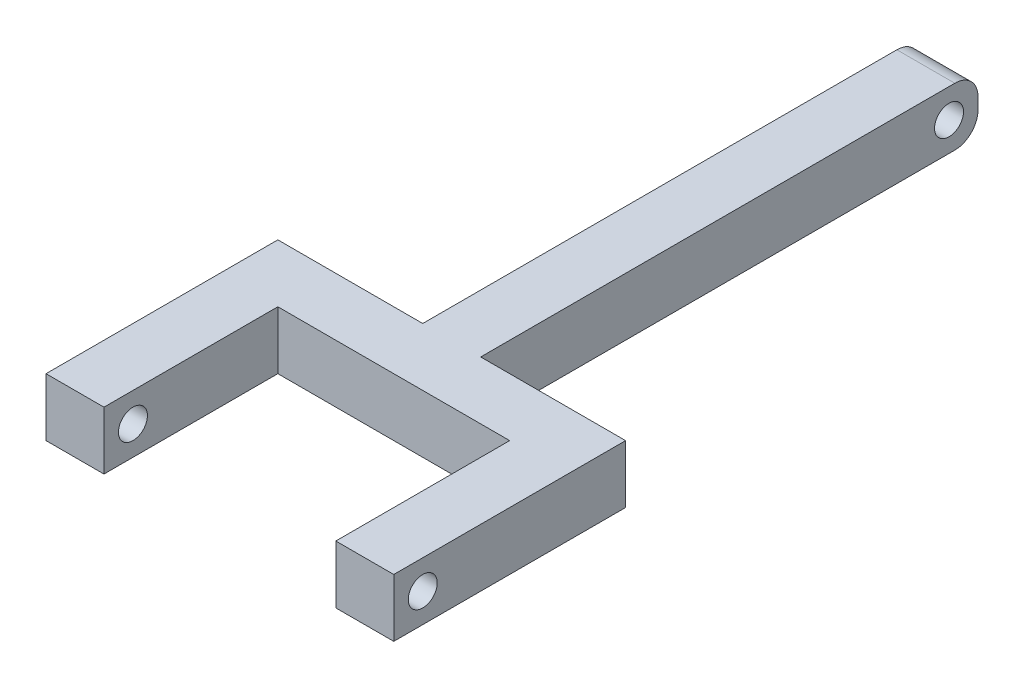
ISO-10303-21;
HEADER;
FILE_DESCRIPTION(('STEP AP214'),'2;1');
FILE_NAME('part.step','',(''),(''),'','','');
FILE_SCHEMA(('AUTOMOTIVE_DESIGN { 1 0 10303 214 1 1 1 1 }'));
ENDSEC;
DATA;
#1=APPLICATION_CONTEXT('core data for automotive mechanical design processes');
#2=APPLICATION_PROTOCOL_DEFINITION('international standard','automotive_design',2000,#1);
#3=PRODUCT_CONTEXT('',#1,'mechanical');
#4=PRODUCT('Part','Part','',(#3));
#5=PRODUCT_RELATED_PRODUCT_CATEGORY('part','',(#4));
#6=PRODUCT_DEFINITION_FORMATION('','',#4);
#7=PRODUCT_DEFINITION_CONTEXT('part definition',#1,'design');
#8=PRODUCT_DEFINITION('design','',#6,#7);
#9=PRODUCT_DEFINITION_SHAPE('','',#8);
#10=(LENGTH_UNIT() NAMED_UNIT(*) SI_UNIT(.MILLI.,.METRE.));
#11=(NAMED_UNIT(*) PLANE_ANGLE_UNIT() SI_UNIT($,.RADIAN.));
#12=(NAMED_UNIT(*) SI_UNIT($,.STERADIAN.) SOLID_ANGLE_UNIT());
#13=UNCERTAINTY_MEASURE_WITH_UNIT(LENGTH_MEASURE(1.E-05),#10,'distance_accuracy_value','');
#14=(GEOMETRIC_REPRESENTATION_CONTEXT(3) GLOBAL_UNCERTAINTY_ASSIGNED_CONTEXT((#13)) GLOBAL_UNIT_ASSIGNED_CONTEXT((#10,
#11,#12)) REPRESENTATION_CONTEXT('',''));
#15=CARTESIAN_POINT('',(0.,0.,0.));
#16=DIRECTION('',(0.,0.,1.));
#17=DIRECTION('',(1.,0.,0.));
#18=AXIS2_PLACEMENT_3D('',#15,#16,#17);
#19=CARTESIAN_POINT('',(-38.1,0.,0.));
#20=DIRECTION('',(1.,0.,0.));
#21=DIRECTION('',(0.,0.,-1.));
#22=AXIS2_PLACEMENT_3D('',#19,#20,#21);
#23=PLANE('',#22);
#24=DIRECTION('',(0.,0.,1.));
#25=VECTOR('',#24,1.);
#26=CARTESIAN_POINT('',(-38.1,6.35,28.956));
#27=LINE('',#26,#25);
#28=CARTESIAN_POINT('',(-38.1,6.35,28.956));
#29=VERTEX_POINT('',#28);
#30=CARTESIAN_POINT('',(-38.1,6.35,79.756));
#31=VERTEX_POINT('',#30);
#32=EDGE_CURVE('E136',#29,#31,#27,.T.);
#33=ORIENTED_EDGE('',*,*,#32,.F.);
#34=DIRECTION('',(0.,1.,0.));
#35=VECTOR('',#34,1.);
#36=CARTESIAN_POINT('',(-38.1,-6.35,28.956));
#37=LINE('',#36,#35);
#38=CARTESIAN_POINT('',(-38.1,-6.35,28.956));
#39=VERTEX_POINT('',#38);
#40=EDGE_CURVE('E209',#39,#29,#37,.T.);
#41=ORIENTED_EDGE('',*,*,#40,.F.);
#42=DIRECTION('',(0.,0.,-1.));
#43=VECTOR('',#42,1.);
#44=CARTESIAN_POINT('',(-38.1,-6.35,41.656));
#45=LINE('',#44,#43);
#46=CARTESIAN_POINT('',(-38.1,-6.35,79.756));
#47=VERTEX_POINT('',#46);
#48=EDGE_CURVE('E149',#47,#39,#45,.T.);
#49=ORIENTED_EDGE('',*,*,#48,.F.);
#50=DIRECTION('',(0.,-1.,0.));
#51=VECTOR('',#50,1.);
#52=CARTESIAN_POINT('',(-38.1,-6.35,79.756));
#53=LINE('',#52,#51);
#54=EDGE_CURVE('E155',#31,#47,#53,.T.);
#55=ORIENTED_EDGE('',*,*,#54,.F.);
#56=EDGE_LOOP('',(#33,#41,#49,#55));
#57=FACE_BOUND('',#56,.T.);
#58=CARTESIAN_POINT('',(-38.1,0.,73.406));
#59=DIRECTION('',(1.,0.,0.));
#60=DIRECTION('',(0.,0.,-1.));
#61=AXIS2_PLACEMENT_3D('',#58,#59,#60);
#62=CIRCLE('',#61,3.17500000000001);
#63=CARTESIAN_POINT('',(-38.1,0.,70.231));
#64=VERTEX_POINT('',#63);
#65=EDGE_CURVE('E163',#64,#64,#62,.F.);
#66=ORIENTED_EDGE('',*,*,#65,.F.);
#67=EDGE_LOOP('',(#66));
#68=FACE_BOUND('',#67,.T.);
#69=ADVANCED_FACE('F33',(#57,#68),#23,.F.);
#70=CARTESIAN_POINT('',(-25.4,-6.35,79.756));
#71=DIRECTION('',(-1.,0.,0.));
#72=DIRECTION('',(0.,0.,1.));
#73=AXIS2_PLACEMENT_3D('',#70,#71,#72);
#74=PLANE('',#73);
#75=DIRECTION('',(0.,0.,-1.));
#76=VECTOR('',#75,1.);
#77=CARTESIAN_POINT('',(-25.4,-6.35,79.756));
#78=LINE('',#77,#76);
#79=CARTESIAN_POINT('',(-25.4,-6.35,79.756));
#80=VERTEX_POINT('',#79);
#81=CARTESIAN_POINT('',(-25.4,-6.35,41.656));
#82=VERTEX_POINT('',#81);
#83=EDGE_CURVE('E174',#80,#82,#78,.T.);
#84=ORIENTED_EDGE('',*,*,#83,.T.);
#85=DIRECTION('',(0.,1.,0.));
#86=VECTOR('',#85,1.);
#87=CARTESIAN_POINT('',(-25.4,0.,41.656));
#88=LINE('',#87,#86);
#89=CARTESIAN_POINT('',(-25.4,6.35,41.656));
#90=VERTEX_POINT('',#89);
#91=EDGE_CURVE('E177',#82,#90,#88,.T.);
#92=ORIENTED_EDGE('',*,*,#91,.T.);
#93=DIRECTION('',(0.,0.,-1.));
#94=VECTOR('',#93,1.);
#95=CARTESIAN_POINT('',(-25.4,6.35,79.756));
#96=LINE('',#95,#94);
#97=CARTESIAN_POINT('',(-25.4,6.35,79.756));
#98=VERTEX_POINT('',#97);
#99=EDGE_CURVE('E173',#98,#90,#96,.T.);
#100=ORIENTED_EDGE('',*,*,#99,.F.);
#101=DIRECTION('',(0.,1.,0.));
#102=VECTOR('',#101,1.);
#103=CARTESIAN_POINT('',(-25.4,-6.35,79.756));
#104=LINE('',#103,#102);
#105=EDGE_CURVE('E157',#80,#98,#104,.T.);
#106=ORIENTED_EDGE('',*,*,#105,.F.);
#107=EDGE_LOOP('',(#84,#92,#100,#106));
#108=FACE_BOUND('',#107,.T.);
#109=CARTESIAN_POINT('',(-25.4,0.,73.406));
#110=DIRECTION('',(-1.,0.,0.));
#111=DIRECTION('',(0.,0.,1.));
#112=AXIS2_PLACEMENT_3D('',#109,#110,#111);
#113=CIRCLE('',#112,3.17500000000001);
#114=CARTESIAN_POINT('',(-25.4,0.,76.581));
#115=VERTEX_POINT('',#114);
#116=EDGE_CURVE('E166',#115,#115,#113,.T.);
#117=ORIENTED_EDGE('',*,*,#116,.T.);
#118=EDGE_LOOP('',(#117));
#119=FACE_BOUND('',#118,.T.);
#120=ADVANCED_FACE('F304',(#108,#119),#74,.F.);
#121=CARTESIAN_POINT('',(0.,0.,41.656));
#122=DIRECTION('',(0.,0.,-1.));
#123=DIRECTION('',(-1.,0.,0.));
#124=AXIS2_PLACEMENT_3D('',#121,#122,#123);
#125=PLANE('',#124);
#126=ORIENTED_EDGE('',*,*,#91,.F.);
#127=DIRECTION('',(1.,0.,0.));
#128=VECTOR('',#127,1.);
#129=CARTESIAN_POINT('',(-6.35,-6.35,41.656));
#130=LINE('',#129,#128);
#131=CARTESIAN_POINT('',(25.4,-6.35,41.656));
#132=VERTEX_POINT('',#131);
#133=EDGE_CURVE('E231',#82,#132,#130,.T.);
#134=ORIENTED_EDGE('',*,*,#133,.T.);
#135=DIRECTION('',(0.,1.,0.));
#136=VECTOR('',#135,1.);
#137=CARTESIAN_POINT('',(25.4,0.,41.656));
#138=LINE('',#137,#136);
#139=CARTESIAN_POINT('',(25.4,6.35,41.656));
#140=VERTEX_POINT('',#139);
#141=EDGE_CURVE('E150',#132,#140,#138,.T.);
#142=ORIENTED_EDGE('',*,*,#141,.T.);
#143=DIRECTION('',(-1.,0.,0.));
#144=VECTOR('',#143,1.);
#145=CARTESIAN_POINT('',(-6.35,6.35,41.656));
#146=LINE('',#145,#144);
#147=EDGE_CURVE('E233',#140,#90,#146,.T.);
#148=ORIENTED_EDGE('',*,*,#147,.T.);
#149=EDGE_LOOP('',(#126,#134,#142,#148));
#150=FACE_BOUND('',#149,.T.);
#151=ADVANCED_FACE('F308',(#150),#125,.F.);
#152=CARTESIAN_POINT('',(-6.35,-6.35,41.656));
#153=DIRECTION('',(1.,0.,0.));
#154=DIRECTION('',(0.,0.,-1.));
#155=AXIS2_PLACEMENT_3D('',#152,#153,#154);
#156=PLANE('',#155);
#157=CARTESIAN_POINT('',(-6.35,0.,-73.66));
#158=DIRECTION('',(-1.,0.,0.));
#159=DIRECTION('',(0.,0.,1.));
#160=AXIS2_PLACEMENT_3D('',#157,#158,#159);
#161=CIRCLE('',#160,3.175);
#162=CARTESIAN_POINT('',(-6.35,0.,-70.485));
#163=VERTEX_POINT('',#162);
#164=EDGE_CURVE('E250',#163,#163,#161,.T.);
#165=ORIENTED_EDGE('',*,*,#164,.F.);
#166=EDGE_LOOP('',(#165));
#167=FACE_BOUND('',#166,.T.);
#168=DIRECTION('',(0.,-1.,0.));
#169=VECTOR('',#168,1.);
#170=CARTESIAN_POINT('',(-6.35,-6.35,-80.01));
#171=LINE('',#170,#169);
#172=CARTESIAN_POINT('',(-6.35,1.27,-80.01));
#173=VERTEX_POINT('',#172);
#174=CARTESIAN_POINT('',(-6.35,-1.27,-80.01));
#175=VERTEX_POINT('',#174);
#176=EDGE_CURVE('E226',#173,#175,#171,.T.);
#177=ORIENTED_EDGE('',*,*,#176,.T.);
#178=CARTESIAN_POINT('',(-6.35,-1.27,-74.93));
#179=DIRECTION('',(1.,0.,0.));
#180=DIRECTION('',(0.,0.,-1.));
#181=AXIS2_PLACEMENT_3D('',#178,#179,#180);
#182=CIRCLE('',#181,5.08);
#183=CARTESIAN_POINT('',(-6.35,-6.35,-74.93));
#184=VERTEX_POINT('',#183);
#185=EDGE_CURVE('E41',#175,#184,#182,.F.);
#186=ORIENTED_EDGE('',*,*,#185,.T.);
#187=DIRECTION('',(0.,0.,-1.));
#188=VECTOR('',#187,1.);
#189=CARTESIAN_POINT('',(-6.35,-6.35,41.656));
#190=LINE('',#189,#188);
#191=CARTESIAN_POINT('',(-6.34999999999999,-6.35,28.956));
#192=VERTEX_POINT('',#191);
#193=EDGE_CURVE('E243',#192,#184,#190,.T.);
#194=ORIENTED_EDGE('',*,*,#193,.F.);
#195=DIRECTION('',(0.,-1.,0.));
#196=VECTOR('',#195,1.);
#197=CARTESIAN_POINT('',(-6.35,-6.35,28.956));
#198=LINE('',#197,#196);
#199=CARTESIAN_POINT('',(-6.35,6.35,28.956));
#200=VERTEX_POINT('',#199);
#201=EDGE_CURVE('E223',#200,#192,#198,.T.);
#202=ORIENTED_EDGE('',*,*,#201,.F.);
#203=DIRECTION('',(0.,0.,-1.));
#204=VECTOR('',#203,1.);
#205=CARTESIAN_POINT('',(-6.35,6.35,41.656));
#206=LINE('',#205,#204);
#207=CARTESIAN_POINT('',(-6.35,6.35,-74.93));
#208=VERTEX_POINT('',#207);
#209=EDGE_CURVE('E235',#200,#208,#206,.T.);
#210=ORIENTED_EDGE('',*,*,#209,.T.);
#211=CARTESIAN_POINT('',(-6.35,1.27,-74.93));
#212=DIRECTION('',(1.,0.,0.));
#213=DIRECTION('',(0.,0.,-1.));
#214=AXIS2_PLACEMENT_3D('',#211,#212,#213);
#215=CIRCLE('',#214,5.08);
#216=EDGE_CURVE('E48',#208,#173,#215,.F.);
#217=ORIENTED_EDGE('',*,*,#216,.T.);
#218=EDGE_LOOP('',(#177,#186,#194,#202,#210,#217));
#219=FACE_BOUND('',#218,.T.);
#220=ADVANCED_FACE('F262',(#167,#219),#156,.F.);
#221=CARTESIAN_POINT('',(6.35,-6.35,41.656));
#222=DIRECTION('',(-1.,0.,0.));
#223=DIRECTION('',(0.,0.,1.));
#224=AXIS2_PLACEMENT_3D('',#221,#222,#223);
#225=PLANE('',#224);
#226=CARTESIAN_POINT('',(6.35,0.,-73.66));
#227=DIRECTION('',(-1.,0.,0.));
#228=DIRECTION('',(0.,0.,1.));
#229=AXIS2_PLACEMENT_3D('',#226,#227,#228);
#230=CIRCLE('',#229,3.175);
#231=CARTESIAN_POINT('',(6.35,0.,-70.485));
#232=VERTEX_POINT('',#231);
#233=EDGE_CURVE('E247',#232,#232,#230,.T.);
#234=ORIENTED_EDGE('',*,*,#233,.T.);
#235=EDGE_LOOP('',(#234));
#236=FACE_BOUND('',#235,.T.);
#237=DIRECTION('',(0.,0.,-1.));
#238=VECTOR('',#237,1.);
#239=CARTESIAN_POINT('',(6.35,-6.35,41.656));
#240=LINE('',#239,#238);
#241=CARTESIAN_POINT('',(6.35,-6.35,28.956));
#242=VERTEX_POINT('',#241);
#243=CARTESIAN_POINT('',(6.35,-6.35,-74.93));
#244=VERTEX_POINT('',#243);
#245=EDGE_CURVE('E240',#242,#244,#240,.T.);
#246=ORIENTED_EDGE('',*,*,#245,.T.);
#247=CARTESIAN_POINT('',(6.35,-1.27,-74.93));
#248=DIRECTION('',(-1.,0.,0.));
#249=DIRECTION('',(0.,0.,1.));
#250=AXIS2_PLACEMENT_3D('',#247,#248,#249);
#251=CIRCLE('',#250,5.08);
#252=CARTESIAN_POINT('',(6.35,-1.27,-80.01));
#253=VERTEX_POINT('',#252);
#254=EDGE_CURVE('E255',#244,#253,#251,.F.);
#255=ORIENTED_EDGE('',*,*,#254,.T.);
#256=DIRECTION('',(0.,1.,0.));
#257=VECTOR('',#256,1.);
#258=CARTESIAN_POINT('',(6.35,-6.35,-80.01));
#259=LINE('',#258,#257);
#260=CARTESIAN_POINT('',(6.35,1.27,-80.01));
#261=VERTEX_POINT('',#260);
#262=EDGE_CURVE('E228',#253,#261,#259,.T.);
#263=ORIENTED_EDGE('',*,*,#262,.T.);
#264=CARTESIAN_POINT('',(6.35,1.27,-74.93));
#265=DIRECTION('',(-1.,0.,0.));
#266=DIRECTION('',(0.,0.,1.));
#267=AXIS2_PLACEMENT_3D('',#264,#265,#266);
#268=CIRCLE('',#267,5.08);
#269=CARTESIAN_POINT('',(6.35,6.35,-74.93));
#270=VERTEX_POINT('',#269);
#271=EDGE_CURVE('E253',#261,#270,#268,.F.);
#272=ORIENTED_EDGE('',*,*,#271,.T.);
#273=DIRECTION('',(0.,0.,-1.));
#274=VECTOR('',#273,1.);
#275=CARTESIAN_POINT('',(6.35,6.35,41.656));
#276=LINE('',#275,#274);
#277=CARTESIAN_POINT('',(6.35000000000002,6.35,28.956));
#278=VERTEX_POINT('',#277);
#279=EDGE_CURVE('E238',#278,#270,#276,.T.);
#280=ORIENTED_EDGE('',*,*,#279,.F.);
#281=DIRECTION('',(0.,1.,0.));
#282=VECTOR('',#281,1.);
#283=CARTESIAN_POINT('',(6.35,-6.35,28.956));
#284=LINE('',#283,#282);
#285=EDGE_CURVE('E220',#242,#278,#284,.T.);
#286=ORIENTED_EDGE('',*,*,#285,.F.);
#287=EDGE_LOOP('',(#246,#255,#263,#272,#280,#286));
#288=FACE_BOUND('',#287,.T.);
#289=ADVANCED_FACE('F271',(#236,#288),#225,.F.);
#290=CARTESIAN_POINT('',(-6.35,-6.35,41.656));
#291=DIRECTION('',(0.,1.,0.));
#292=DIRECTION('',(0.,0.,1.));
#293=AXIS2_PLACEMENT_3D('',#290,#291,#292);
#294=PLANE('',#293);
#295=ORIENTED_EDGE('',*,*,#193,.T.);
#296=DIRECTION('',(1.,0.,0.));
#297=VECTOR('',#296,1.);
#298=CARTESIAN_POINT('',(6.35,-6.35,-74.93));
#299=LINE('',#298,#297);
#300=EDGE_CURVE('E246',#184,#244,#299,.T.);
#301=ORIENTED_EDGE('',*,*,#300,.T.);
#302=ORIENTED_EDGE('',*,*,#245,.F.);
#303=DIRECTION('',(-1.,0.,0.));
#304=VECTOR('',#303,1.);
#305=CARTESIAN_POINT('',(38.1,-6.35,28.956));
#306=LINE('',#305,#304);
#307=CARTESIAN_POINT('',(38.1,-6.35,28.956));
#308=VERTEX_POINT('',#307);
#309=EDGE_CURVE('E218',#308,#242,#306,.T.);
#310=ORIENTED_EDGE('',*,*,#309,.F.);
#311=DIRECTION('',(0.,0.,-1.));
#312=VECTOR('',#311,1.);
#313=CARTESIAN_POINT('',(38.1,-6.35,41.656));
#314=LINE('',#313,#312);
#315=CARTESIAN_POINT('',(38.1,-6.35,79.756));
#316=VERTEX_POINT('',#315);
#317=EDGE_CURVE('E208',#316,#308,#314,.T.);
#318=ORIENTED_EDGE('',*,*,#317,.F.);
#319=DIRECTION('',(-1.,0.,0.));
#320=VECTOR('',#319,1.);
#321=CARTESIAN_POINT('',(38.1,-6.35,79.756));
#322=LINE('',#321,#320);
#323=CARTESIAN_POINT('',(25.4,-6.35,79.756));
#324=VERTEX_POINT('',#323);
#325=EDGE_CURVE('E190',#316,#324,#322,.T.);
#326=ORIENTED_EDGE('',*,*,#325,.T.);
#327=DIRECTION('',(0.,0.,-1.));
#328=VECTOR('',#327,1.);
#329=CARTESIAN_POINT('',(25.4,-6.35,79.756));
#330=LINE('',#329,#328);
#331=EDGE_CURVE('E199',#324,#132,#330,.T.);
#332=ORIENTED_EDGE('',*,*,#331,.T.);
#333=ORIENTED_EDGE('',*,*,#133,.F.);
#334=ORIENTED_EDGE('',*,*,#83,.F.);
#335=DIRECTION('',(1.,0.,0.));
#336=VECTOR('',#335,1.);
#337=CARTESIAN_POINT('',(-38.1,-6.35,79.756));
#338=LINE('',#337,#336);
#339=EDGE_CURVE('E171',#47,#80,#338,.T.);
#340=ORIENTED_EDGE('',*,*,#339,.F.);
#341=ORIENTED_EDGE('',*,*,#48,.T.);
#342=EDGE_CURVE('E217',#192,#39,#306,.T.);
#343=ORIENTED_EDGE('',*,*,#342,.F.);
#344=EDGE_LOOP('',(#295,#301,#302,#310,#318,#326,#332,#333,#334,#340,#341,#343));
#345=FACE_BOUND('',#344,.T.);
#346=ADVANCED_FACE('F267',(#345),#294,.F.);
#347=CARTESIAN_POINT('',(-6.35,6.35,41.656));
#348=DIRECTION('',(0.,-1.,0.));
#349=DIRECTION('',(0.,0.,-1.));
#350=AXIS2_PLACEMENT_3D('',#347,#348,#349);
#351=PLANE('',#350);
#352=ORIENTED_EDGE('',*,*,#279,.T.);
#353=DIRECTION('',(-1.,0.,0.));
#354=VECTOR('',#353,1.);
#355=CARTESIAN_POINT('',(-6.35,6.35,-74.93));
#356=LINE('',#355,#354);
#357=EDGE_CURVE('E11',#270,#208,#356,.T.);
#358=ORIENTED_EDGE('',*,*,#357,.T.);
#359=ORIENTED_EDGE('',*,*,#209,.F.);
#360=DIRECTION('',(-1.,0.,0.));
#361=VECTOR('',#360,1.);
#362=CARTESIAN_POINT('',(38.1,6.35,28.956));
#363=LINE('',#362,#361);
#364=EDGE_CURVE('E144',#200,#29,#363,.T.);
#365=ORIENTED_EDGE('',*,*,#364,.T.);
#366=ORIENTED_EDGE('',*,*,#32,.T.);
#367=DIRECTION('',(-1.,0.,0.));
#368=VECTOR('',#367,1.);
#369=CARTESIAN_POINT('',(-38.1,6.35,79.756));
#370=LINE('',#369,#368);
#371=EDGE_CURVE('E141',#98,#31,#370,.T.);
#372=ORIENTED_EDGE('',*,*,#371,.F.);
#373=ORIENTED_EDGE('',*,*,#99,.T.);
#374=ORIENTED_EDGE('',*,*,#147,.F.);
#375=DIRECTION('',(0.,0.,-1.));
#376=VECTOR('',#375,1.);
#377=CARTESIAN_POINT('',(25.4,6.35,79.756));
#378=LINE('',#377,#376);
#379=CARTESIAN_POINT('',(25.4,6.35,79.756));
#380=VERTEX_POINT('',#379);
#381=EDGE_CURVE('E200',#380,#140,#378,.T.);
#382=ORIENTED_EDGE('',*,*,#381,.F.);
#383=DIRECTION('',(1.,0.,0.));
#384=VECTOR('',#383,1.);
#385=CARTESIAN_POINT('',(38.1,6.35,79.756));
#386=LINE('',#385,#384);
#387=CARTESIAN_POINT('',(38.1,6.35,79.756));
#388=VERTEX_POINT('',#387);
#389=EDGE_CURVE('E196',#380,#388,#386,.T.);
#390=ORIENTED_EDGE('',*,*,#389,.T.);
#391=DIRECTION('',(0.,0.,1.));
#392=VECTOR('',#391,1.);
#393=CARTESIAN_POINT('',(38.1,6.35,28.956));
#394=LINE('',#393,#392);
#395=CARTESIAN_POINT('',(38.1,6.35,28.956));
#396=VERTEX_POINT('',#395);
#397=EDGE_CURVE('E206',#396,#388,#394,.T.);
#398=ORIENTED_EDGE('',*,*,#397,.F.);
#399=EDGE_CURVE('E215',#396,#278,#363,.T.);
#400=ORIENTED_EDGE('',*,*,#399,.T.);
#401=EDGE_LOOP('',(#352,#358,#359,#365,#366,#372,#373,#374,#382,#390,#398,#400));
#402=FACE_BOUND('',#401,.T.);
#403=ADVANCED_FACE('F139',(#402),#351,.F.);
#404=CARTESIAN_POINT('',(0.,0.,-80.01));
#405=DIRECTION('',(0.,0.,-1.));
#406=DIRECTION('',(-1.,0.,0.));
#407=AXIS2_PLACEMENT_3D('',#404,#405,#406);
#408=PLANE('',#407);
#409=ORIENTED_EDGE('',*,*,#262,.F.);
#410=DIRECTION('',(1.,0.,0.));
#411=VECTOR('',#410,1.);
#412=CARTESIAN_POINT('',(-6.35,-1.27,-80.01));
#413=LINE('',#412,#411);
#414=EDGE_CURVE('E55',#253,#175,#413,.F.);
#415=ORIENTED_EDGE('',*,*,#414,.T.);
#416=ORIENTED_EDGE('',*,*,#176,.F.);
#417=DIRECTION('',(-1.,0.,0.));
#418=VECTOR('',#417,1.);
#419=CARTESIAN_POINT('',(6.35,1.27,-80.01));
#420=LINE('',#419,#418);
#421=EDGE_CURVE('E257',#173,#261,#420,.F.);
#422=ORIENTED_EDGE('',*,*,#421,.T.);
#423=EDGE_LOOP('',(#409,#415,#416,#422));
#424=FACE_BOUND('',#423,.T.);
#425=ADVANCED_FACE('F274',(#424),#408,.T.);
#426=CARTESIAN_POINT('',(38.1,0.,0.));
#427=DIRECTION('',(1.,0.,0.));
#428=DIRECTION('',(0.,0.,-1.));
#429=AXIS2_PLACEMENT_3D('',#426,#427,#428);
#430=PLANE('',#429);
#431=CARTESIAN_POINT('',(38.1,0.,73.406));
#432=DIRECTION('',(1.,0.,0.));
#433=DIRECTION('',(0.,0.,-1.));
#434=AXIS2_PLACEMENT_3D('',#431,#432,#433);
#435=CIRCLE('',#434,3.17500000000001);
#436=CARTESIAN_POINT('',(38.1,0.,70.231));
#437=VERTEX_POINT('',#436);
#438=EDGE_CURVE('E184',#437,#437,#435,.T.);
#439=ORIENTED_EDGE('',*,*,#438,.F.);
#440=EDGE_LOOP('',(#439));
#441=FACE_BOUND('',#440,.T.);
#442=ORIENTED_EDGE('',*,*,#397,.T.);
#443=DIRECTION('',(0.,-1.,0.));
#444=VECTOR('',#443,1.);
#445=CARTESIAN_POINT('',(38.1,-6.35,79.756));
#446=LINE('',#445,#444);
#447=EDGE_CURVE('E187',#388,#316,#446,.T.);
#448=ORIENTED_EDGE('',*,*,#447,.T.);
#449=ORIENTED_EDGE('',*,*,#317,.T.);
#450=DIRECTION('',(0.,1.,0.));
#451=VECTOR('',#450,1.);
#452=CARTESIAN_POINT('',(38.1,-6.35,28.956));
#453=LINE('',#452,#451);
#454=EDGE_CURVE('E211',#308,#396,#453,.T.);
#455=ORIENTED_EDGE('',*,*,#454,.T.);
#456=EDGE_LOOP('',(#442,#448,#449,#455));
#457=FACE_BOUND('',#456,.T.);
#458=ADVANCED_FACE('F289',(#441,#457),#430,.T.);
#459=CARTESIAN_POINT('',(38.1,-6.35,28.956));
#460=DIRECTION('',(0.,0.,1.));
#461=DIRECTION('',(1.,0.,0.));
#462=AXIS2_PLACEMENT_3D('',#459,#460,#461);
#463=PLANE('',#462);
#464=ORIENTED_EDGE('',*,*,#285,.T.);
#465=ORIENTED_EDGE('',*,*,#399,.F.);
#466=ORIENTED_EDGE('',*,*,#454,.F.);
#467=ORIENTED_EDGE('',*,*,#309,.T.);
#468=EDGE_LOOP('',(#464,#465,#466,#467));
#469=FACE_BOUND('',#468,.T.);
#470=ADVANCED_FACE('F280',(#469),#463,.F.);
#471=ORIENTED_EDGE('',*,*,#40,.T.);
#472=ORIENTED_EDGE('',*,*,#364,.F.);
#473=ORIENTED_EDGE('',*,*,#201,.T.);
#474=ORIENTED_EDGE('',*,*,#342,.T.);
#475=EDGE_LOOP('',(#471,#472,#473,#474));
#476=FACE_BOUND('',#475,.T.);
#477=ADVANCED_FACE('F297',(#476),#463,.F.);
#478=CARTESIAN_POINT('',(25.4,-6.35,79.756));
#479=DIRECTION('',(-1.,0.,0.));
#480=DIRECTION('',(0.,0.,1.));
#481=AXIS2_PLACEMENT_3D('',#478,#479,#480);
#482=PLANE('',#481);
#483=CARTESIAN_POINT('',(25.4,0.,73.406));
#484=DIRECTION('',(-1.,0.,0.));
#485=DIRECTION('',(0.,0.,1.));
#486=AXIS2_PLACEMENT_3D('',#483,#484,#485);
#487=CIRCLE('',#486,3.17500000000001);
#488=CARTESIAN_POINT('',(25.4,0.,76.581));
#489=VERTEX_POINT('',#488);
#490=EDGE_CURVE('E181',#489,#489,#487,.T.);
#491=ORIENTED_EDGE('',*,*,#490,.F.);
#492=EDGE_LOOP('',(#491));
#493=FACE_BOUND('',#492,.T.);
#494=ORIENTED_EDGE('',*,*,#141,.F.);
#495=ORIENTED_EDGE('',*,*,#331,.F.);
#496=DIRECTION('',(0.,1.,0.));
#497=VECTOR('',#496,1.);
#498=CARTESIAN_POINT('',(25.4,-6.35,79.756));
#499=LINE('',#498,#497);
#500=EDGE_CURVE('E193',#324,#380,#499,.T.);
#501=ORIENTED_EDGE('',*,*,#500,.T.);
#502=ORIENTED_EDGE('',*,*,#381,.T.);
#503=EDGE_LOOP('',(#494,#495,#501,#502));
#504=FACE_BOUND('',#503,.T.);
#505=ADVANCED_FACE('F312',(#493,#504),#482,.T.);
#506=CARTESIAN_POINT('',(0.,0.,79.756));
#507=DIRECTION('',(0.,0.,1.));
#508=DIRECTION('',(1.,0.,0.));
#509=AXIS2_PLACEMENT_3D('',#506,#507,#508);
#510=PLANE('',#509);
#511=ORIENTED_EDGE('',*,*,#447,.F.);
#512=ORIENTED_EDGE('',*,*,#389,.F.);
#513=ORIENTED_EDGE('',*,*,#500,.F.);
#514=ORIENTED_EDGE('',*,*,#325,.F.);
#515=EDGE_LOOP('',(#511,#512,#513,#514));
#516=FACE_BOUND('',#515,.T.);
#517=ADVANCED_FACE('F287',(#516),#510,.T.);
#518=CARTESIAN_POINT('',(41.91,0.,73.406));
#519=DIRECTION('',(-1.,0.,0.));
#520=DIRECTION('',(0.,0.,1.));
#521=AXIS2_PLACEMENT_3D('',#518,#519,#520);
#522=CYLINDRICAL_SURFACE('',#521,3.17500000000001);
#523=ORIENTED_EDGE('',*,*,#438,.T.);
#524=EDGE_LOOP('',(#523));
#525=FACE_BOUND('',#524,.T.);
#526=ORIENTED_EDGE('',*,*,#490,.T.);
#527=EDGE_LOOP('',(#526));
#528=FACE_BOUND('',#527,.T.);
#529=ADVANCED_FACE('F345',(#525,#528),#522,.F.);
#530=CARTESIAN_POINT('',(0.,0.,79.756));
#531=DIRECTION('',(0.,0.,1.));
#532=DIRECTION('',(-1.,0.,0.));
#533=AXIS2_PLACEMENT_3D('',#530,#531,#532);
#534=PLANE('',#533);
#535=ORIENTED_EDGE('',*,*,#54,.T.);
#536=ORIENTED_EDGE('',*,*,#339,.T.);
#537=ORIENTED_EDGE('',*,*,#105,.T.);
#538=ORIENTED_EDGE('',*,*,#371,.T.);
#539=EDGE_LOOP('',(#535,#536,#537,#538));
#540=FACE_BOUND('',#539,.T.);
#541=ADVANCED_FACE('F154',(#540),#534,.T.);
#542=CARTESIAN_POINT('',(-41.91,0.,73.406));
#543=DIRECTION('',(1.,0.,0.));
#544=DIRECTION('',(0.,0.,-1.));
#545=AXIS2_PLACEMENT_3D('',#542,#543,#544);
#546=CYLINDRICAL_SURFACE('',#545,3.17500000000001);
#547=ORIENTED_EDGE('',*,*,#116,.F.);
#548=EDGE_LOOP('',(#547));
#549=FACE_BOUND('',#548,.T.);
#550=ORIENTED_EDGE('',*,*,#65,.T.);
#551=EDGE_LOOP('',(#550));
#552=FACE_BOUND('',#551,.T.);
#553=ADVANCED_FACE('F333',(#549,#552),#546,.F.);
#554=CARTESIAN_POINT('',(38.1,0.,-73.66));
#555=DIRECTION('',(-1.,0.,0.));
#556=DIRECTION('',(0.,0.,1.));
#557=AXIS2_PLACEMENT_3D('',#554,#555,#556);
#558=CYLINDRICAL_SURFACE('',#557,3.175);
#559=ORIENTED_EDGE('',*,*,#164,.T.);
#560=EDGE_LOOP('',(#559));
#561=FACE_BOUND('',#560,.T.);
#562=ORIENTED_EDGE('',*,*,#233,.F.);
#563=EDGE_LOOP('',(#562));
#564=FACE_BOUND('',#563,.T.);
#565=ADVANCED_FACE('F328',(#561,#564),#558,.F.);
#566=CARTESIAN_POINT('',(-6.35,-1.27,-74.93));
#567=DIRECTION('',(-1.,0.,0.));
#568=DIRECTION('',(0.,0.,1.));
#569=AXIS2_PLACEMENT_3D('',#566,#567,#568);
#570=CYLINDRICAL_SURFACE('',#569,5.08);
#571=ORIENTED_EDGE('',*,*,#185,.F.);
#572=ORIENTED_EDGE('',*,*,#414,.F.);
#573=ORIENTED_EDGE('',*,*,#254,.F.);
#574=ORIENTED_EDGE('',*,*,#300,.F.);
#575=EDGE_LOOP('',(#571,#572,#573,#574));
#576=FACE_BOUND('',#575,.T.);
#577=ADVANCED_FACE('F269',(#576),#570,.T.);
#578=CARTESIAN_POINT('',(-6.35,1.27,-74.93));
#579=DIRECTION('',(1.,0.,0.));
#580=DIRECTION('',(0.,0.,-1.));
#581=AXIS2_PLACEMENT_3D('',#578,#579,#580);
#582=CYLINDRICAL_SURFACE('',#581,5.08);
#583=ORIENTED_EDGE('',*,*,#271,.F.);
#584=ORIENTED_EDGE('',*,*,#421,.F.);
#585=ORIENTED_EDGE('',*,*,#216,.F.);
#586=ORIENTED_EDGE('',*,*,#357,.F.);
#587=EDGE_LOOP('',(#583,#584,#585,#586));
#588=FACE_BOUND('',#587,.T.);
#589=ADVANCED_FACE('F35',(#588),#582,.T.);
#590=CLOSED_SHELL('',(#69,#120,#151,#220,#289,#346,#403,#425,#458,#470,#477,#505,#517,#529,#541,
#553,#565,#577,#589));
#591=MANIFOLD_SOLID_BREP('B2',#590);
#592=ADVANCED_BREP_SHAPE_REPRESENTATION('',(#18,#591),#14);
#593=SHAPE_DEFINITION_REPRESENTATION(#9,#592);
ENDSEC;
END-ISO-10303-21;
